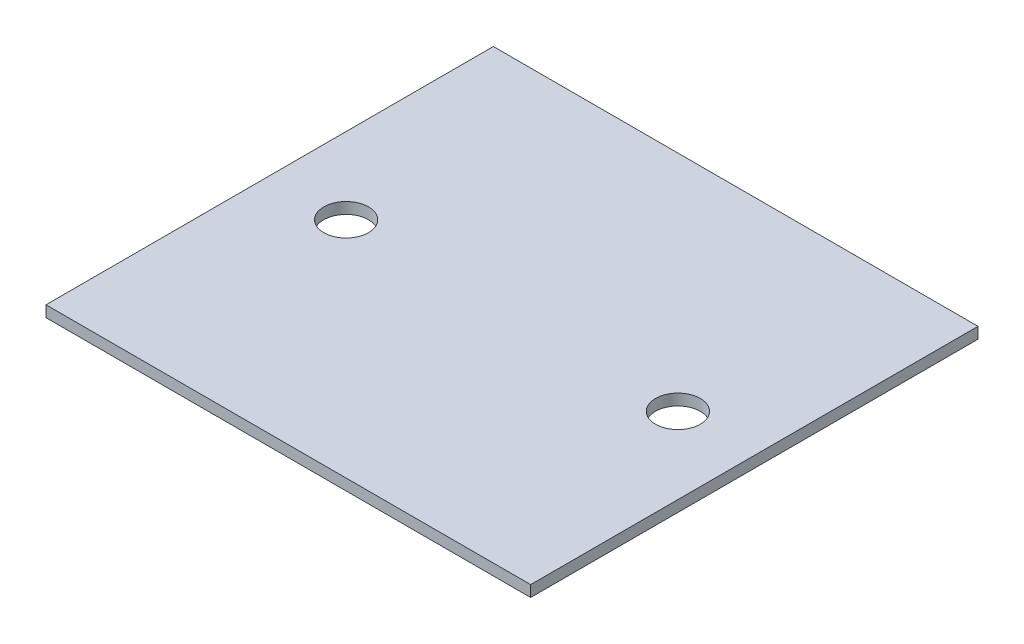
ISO-10303-21;
HEADER;
FILE_DESCRIPTION(('STEP AP214'),'2;1');
FILE_NAME('part.step','',(''),(''),'','','');
FILE_SCHEMA(('AUTOMOTIVE_DESIGN { 1 0 10303 214 1 1 1 1 }'));
ENDSEC;
DATA;
#1=APPLICATION_CONTEXT('core data for automotive mechanical design processes');
#2=APPLICATION_PROTOCOL_DEFINITION('international standard','automotive_design',2000,#1);
#3=PRODUCT_CONTEXT('',#1,'mechanical');
#4=PRODUCT('Part','Part','',(#3));
#5=PRODUCT_RELATED_PRODUCT_CATEGORY('part','',(#4));
#6=PRODUCT_DEFINITION_FORMATION('','',#4);
#7=PRODUCT_DEFINITION_CONTEXT('part definition',#1,'design');
#8=PRODUCT_DEFINITION('design','',#6,#7);
#9=PRODUCT_DEFINITION_SHAPE('','',#8);
#10=(LENGTH_UNIT() NAMED_UNIT(*) SI_UNIT(.MILLI.,.METRE.));
#11=(NAMED_UNIT(*) PLANE_ANGLE_UNIT() SI_UNIT($,.RADIAN.));
#12=(NAMED_UNIT(*) SI_UNIT($,.STERADIAN.) SOLID_ANGLE_UNIT());
#13=UNCERTAINTY_MEASURE_WITH_UNIT(LENGTH_MEASURE(1.E-05),#10,'distance_accuracy_value','');
#14=(GEOMETRIC_REPRESENTATION_CONTEXT(3) GLOBAL_UNCERTAINTY_ASSIGNED_CONTEXT((#13)) GLOBAL_UNIT_ASSIGNED_CONTEXT((#10,
#11,#12)) REPRESENTATION_CONTEXT('',''));
#15=CARTESIAN_POINT('',(0.,0.,0.));
#16=DIRECTION('',(0.,0.,1.));
#17=DIRECTION('',(1.,0.,0.));
#18=AXIS2_PLACEMENT_3D('',#15,#16,#17);
#19=CARTESIAN_POINT('',(65.,3.,60.));
#20=DIRECTION('',(-1.,0.,0.));
#21=DIRECTION('',(0.,0.,1.));
#22=AXIS2_PLACEMENT_3D('',#19,#20,#21);
#23=PLANE('',#22);
#24=DIRECTION('',(0.,0.,-1.));
#25=VECTOR('',#24,1.);
#26=CARTESIAN_POINT('',(65.,0.,60.));
#27=LINE('',#26,#25);
#28=CARTESIAN_POINT('',(65.,0.,60.));
#29=VERTEX_POINT('',#28);
#30=CARTESIAN_POINT('',(65.,0.,-60.));
#31=VERTEX_POINT('',#30);
#32=EDGE_CURVE('E95',#29,#31,#27,.T.);
#33=ORIENTED_EDGE('',*,*,#32,.T.);
#34=DIRECTION('',(0.,-1.,0.));
#35=VECTOR('',#34,1.);
#36=CARTESIAN_POINT('',(65.,3.,-60.));
#37=LINE('',#36,#35);
#38=CARTESIAN_POINT('',(65.,3.,-60.));
#39=VERTEX_POINT('',#38);
#40=EDGE_CURVE('E11',#39,#31,#37,.T.);
#41=ORIENTED_EDGE('',*,*,#40,.F.);
#42=DIRECTION('',(0.,0.,-1.));
#43=VECTOR('',#42,1.);
#44=CARTESIAN_POINT('',(65.,3.,60.));
#45=LINE('',#44,#43);
#46=CARTESIAN_POINT('',(65.,3.,60.));
#47=VERTEX_POINT('',#46);
#48=EDGE_CURVE('E83',#47,#39,#45,.T.);
#49=ORIENTED_EDGE('',*,*,#48,.F.);
#50=DIRECTION('',(0.,-1.,0.));
#51=VECTOR('',#50,1.);
#52=CARTESIAN_POINT('',(65.,3.,60.));
#53=LINE('',#52,#51);
#54=EDGE_CURVE('E91',#47,#29,#53,.T.);
#55=ORIENTED_EDGE('',*,*,#54,.T.);
#56=EDGE_LOOP('',(#33,#41,#49,#55));
#57=FACE_BOUND('',#56,.T.);
#58=ADVANCED_FACE('F32',(#57),#23,.F.);
#59=CARTESIAN_POINT('',(-65.,3.,-60.));
#60=DIRECTION('',(0.,0.,1.));
#61=DIRECTION('',(1.,0.,0.));
#62=AXIS2_PLACEMENT_3D('',#59,#60,#61);
#63=PLANE('',#62);
#64=DIRECTION('',(-1.,0.,0.));
#65=VECTOR('',#64,1.);
#66=CARTESIAN_POINT('',(-65.,0.,-60.));
#67=LINE('',#66,#65);
#68=CARTESIAN_POINT('',(-65.,0.,-60.));
#69=VERTEX_POINT('',#68);
#70=EDGE_CURVE('E87',#31,#69,#67,.T.);
#71=ORIENTED_EDGE('',*,*,#70,.T.);
#72=DIRECTION('',(0.,-1.,0.));
#73=VECTOR('',#72,1.);
#74=CARTESIAN_POINT('',(-65.,3.,-60.));
#75=LINE('',#74,#73);
#76=CARTESIAN_POINT('',(-65.,3.,-60.));
#77=VERTEX_POINT('',#76);
#78=EDGE_CURVE('E40',#77,#69,#75,.T.);
#79=ORIENTED_EDGE('',*,*,#78,.F.);
#80=DIRECTION('',(-1.,0.,0.));
#81=VECTOR('',#80,1.);
#82=CARTESIAN_POINT('',(-65.,3.,-60.));
#83=LINE('',#82,#81);
#84=EDGE_CURVE('E78',#39,#77,#83,.T.);
#85=ORIENTED_EDGE('',*,*,#84,.F.);
#86=ORIENTED_EDGE('',*,*,#40,.T.);
#87=EDGE_LOOP('',(#71,#79,#85,#86));
#88=FACE_BOUND('',#87,.T.);
#89=ADVANCED_FACE('F86',(#88),#63,.F.);
#90=CARTESIAN_POINT('',(-65.,3.,60.));
#91=DIRECTION('',(1.,0.,0.));
#92=DIRECTION('',(0.,0.,-1.));
#93=AXIS2_PLACEMENT_3D('',#90,#91,#92);
#94=PLANE('',#93);
#95=DIRECTION('',(0.,0.,1.));
#96=VECTOR('',#95,1.);
#97=CARTESIAN_POINT('',(-65.,0.,60.));
#98=LINE('',#97,#96);
#99=CARTESIAN_POINT('',(-65.,0.,60.));
#100=VERTEX_POINT('',#99);
#101=EDGE_CURVE('E65',#69,#100,#98,.T.);
#102=ORIENTED_EDGE('',*,*,#101,.T.);
#103=DIRECTION('',(0.,-1.,0.));
#104=VECTOR('',#103,1.);
#105=CARTESIAN_POINT('',(-65.,3.,60.));
#106=LINE('',#105,#104);
#107=CARTESIAN_POINT('',(-65.,3.,60.));
#108=VERTEX_POINT('',#107);
#109=EDGE_CURVE('E88',#108,#100,#106,.T.);
#110=ORIENTED_EDGE('',*,*,#109,.F.);
#111=DIRECTION('',(0.,0.,1.));
#112=VECTOR('',#111,1.);
#113=CARTESIAN_POINT('',(-65.,3.,60.));
#114=LINE('',#113,#112);
#115=EDGE_CURVE('E81',#77,#108,#114,.T.);
#116=ORIENTED_EDGE('',*,*,#115,.F.);
#117=ORIENTED_EDGE('',*,*,#78,.T.);
#118=EDGE_LOOP('',(#102,#110,#116,#117));
#119=FACE_BOUND('',#118,.T.);
#120=ADVANCED_FACE('F89',(#119),#94,.F.);
#121=CARTESIAN_POINT('',(-65.,3.,60.));
#122=DIRECTION('',(0.,0.,-1.));
#123=DIRECTION('',(-1.,0.,0.));
#124=AXIS2_PLACEMENT_3D('',#121,#122,#123);
#125=PLANE('',#124);
#126=DIRECTION('',(1.,0.,0.));
#127=VECTOR('',#126,1.);
#128=CARTESIAN_POINT('',(-65.,0.,60.));
#129=LINE('',#128,#127);
#130=EDGE_CURVE('E71',#100,#29,#129,.T.);
#131=ORIENTED_EDGE('',*,*,#130,.T.);
#132=ORIENTED_EDGE('',*,*,#54,.F.);
#133=DIRECTION('',(1.,0.,0.));
#134=VECTOR('',#133,1.);
#135=CARTESIAN_POINT('',(-65.,3.,60.));
#136=LINE('',#135,#134);
#137=EDGE_CURVE('E48',#108,#47,#136,.T.);
#138=ORIENTED_EDGE('',*,*,#137,.F.);
#139=ORIENTED_EDGE('',*,*,#109,.T.);
#140=EDGE_LOOP('',(#131,#132,#138,#139));
#141=FACE_BOUND('',#140,.T.);
#142=ADVANCED_FACE('F103',(#141),#125,.F.);
#143=CARTESIAN_POINT('',(0.,3.,0.));
#144=DIRECTION('',(0.,-1.,0.));
#145=DIRECTION('',(0.,0.,-1.));
#146=AXIS2_PLACEMENT_3D('',#143,#144,#145);
#147=PLANE('',#146);
#148=CARTESIAN_POINT('',(-44.5,3.,0.));
#149=DIRECTION('',(0.,-1.,0.));
#150=DIRECTION('',(0.,0.,-1.));
#151=AXIS2_PLACEMENT_3D('',#148,#149,#150);
#152=CIRCLE('',#151,6.);
#153=CARTESIAN_POINT('',(-44.5,3.,-6.));
#154=VERTEX_POINT('',#153);
#155=EDGE_CURVE('E114',#154,#154,#152,.F.);
#156=ORIENTED_EDGE('',*,*,#155,.F.);
#157=EDGE_LOOP('',(#156));
#158=FACE_BOUND('',#157,.T.);
#159=CARTESIAN_POINT('',(44.5,3.,0.));
#160=DIRECTION('',(0.,-1.,0.));
#161=DIRECTION('',(0.,0.,-1.));
#162=AXIS2_PLACEMENT_3D('',#159,#160,#161);
#163=CIRCLE('',#162,6.);
#164=CARTESIAN_POINT('',(44.5,3.,-6.));
#165=VERTEX_POINT('',#164);
#166=EDGE_CURVE('E98',#165,#165,#163,.T.);
#167=ORIENTED_EDGE('',*,*,#166,.T.);
#168=EDGE_LOOP('',(#167));
#169=FACE_BOUND('',#168,.T.);
#170=ORIENTED_EDGE('',*,*,#48,.T.);
#171=ORIENTED_EDGE('',*,*,#84,.T.);
#172=ORIENTED_EDGE('',*,*,#115,.T.);
#173=ORIENTED_EDGE('',*,*,#137,.T.);
#174=EDGE_LOOP('',(#170,#171,#172,#173));
#175=FACE_BOUND('',#174,.T.);
#176=ADVANCED_FACE('F79',(#158,#169,#175),#147,.F.);
#177=CARTESIAN_POINT('',(0.,0.,0.));
#178=DIRECTION('',(0.,-1.,0.));
#179=DIRECTION('',(0.,0.,-1.));
#180=AXIS2_PLACEMENT_3D('',#177,#178,#179);
#181=PLANE('',#180);
#182=CARTESIAN_POINT('',(-44.5,0.,0.));
#183=DIRECTION('',(0.,-1.,0.));
#184=DIRECTION('',(0.,0.,1.));
#185=AXIS2_PLACEMENT_3D('',#182,#183,#184);
#186=CIRCLE('',#185,6.);
#187=CARTESIAN_POINT('',(-44.5,0.,6.));
#188=VERTEX_POINT('',#187);
#189=EDGE_CURVE('E117',#188,#188,#186,.T.);
#190=ORIENTED_EDGE('',*,*,#189,.F.);
#191=EDGE_LOOP('',(#190));
#192=FACE_BOUND('',#191,.T.);
#193=CARTESIAN_POINT('',(44.5,0.,0.));
#194=DIRECTION('',(0.,1.,0.));
#195=DIRECTION('',(0.,0.,1.));
#196=AXIS2_PLACEMENT_3D('',#193,#194,#195);
#197=CIRCLE('',#196,6.);
#198=CARTESIAN_POINT('',(44.5,0.,6.));
#199=VERTEX_POINT('',#198);
#200=EDGE_CURVE('E111',#199,#199,#197,.T.);
#201=ORIENTED_EDGE('',*,*,#200,.T.);
#202=EDGE_LOOP('',(#201));
#203=FACE_BOUND('',#202,.T.);
#204=ORIENTED_EDGE('',*,*,#32,.F.);
#205=ORIENTED_EDGE('',*,*,#130,.F.);
#206=ORIENTED_EDGE('',*,*,#101,.F.);
#207=ORIENTED_EDGE('',*,*,#70,.F.);
#208=EDGE_LOOP('',(#204,#205,#206,#207));
#209=FACE_BOUND('',#208,.T.);
#210=ADVANCED_FACE('F106',(#192,#203,#209),#181,.T.);
#211=CARTESIAN_POINT('',(44.5,0.,0.));
#212=DIRECTION('',(0.,1.,0.));
#213=DIRECTION('',(0.,0.,1.));
#214=AXIS2_PLACEMENT_3D('',#211,#212,#213);
#215=CYLINDRICAL_SURFACE('',#214,6.);
#216=ORIENTED_EDGE('',*,*,#200,.F.);
#217=EDGE_LOOP('',(#216));
#218=FACE_BOUND('',#217,.T.);
#219=ORIENTED_EDGE('',*,*,#166,.F.);
#220=EDGE_LOOP('',(#219));
#221=FACE_BOUND('',#220,.T.);
#222=ADVANCED_FACE('F126',(#218,#221),#215,.F.);
#223=CARTESIAN_POINT('',(-44.5,0.,0.));
#224=DIRECTION('',(0.,1.,0.));
#225=DIRECTION('',(0.,0.,1.));
#226=AXIS2_PLACEMENT_3D('',#223,#224,#225);
#227=CYLINDRICAL_SURFACE('',#226,6.);
#228=ORIENTED_EDGE('',*,*,#189,.T.);
#229=EDGE_LOOP('',(#228));
#230=FACE_BOUND('',#229,.T.);
#231=ORIENTED_EDGE('',*,*,#155,.T.);
#232=EDGE_LOOP('',(#231));
#233=FACE_BOUND('',#232,.T.);
#234=ADVANCED_FACE('F121',(#230,#233),#227,.F.);
#235=CLOSED_SHELL('',(#58,#89,#120,#142,#176,#210,#222,#234));
#236=MANIFOLD_SOLID_BREP('B2',#235);
#237=ADVANCED_BREP_SHAPE_REPRESENTATION('',(#18,#236),#14);
#238=SHAPE_DEFINITION_REPRESENTATION(#9,#237);
ENDSEC;
END-ISO-10303-21;
